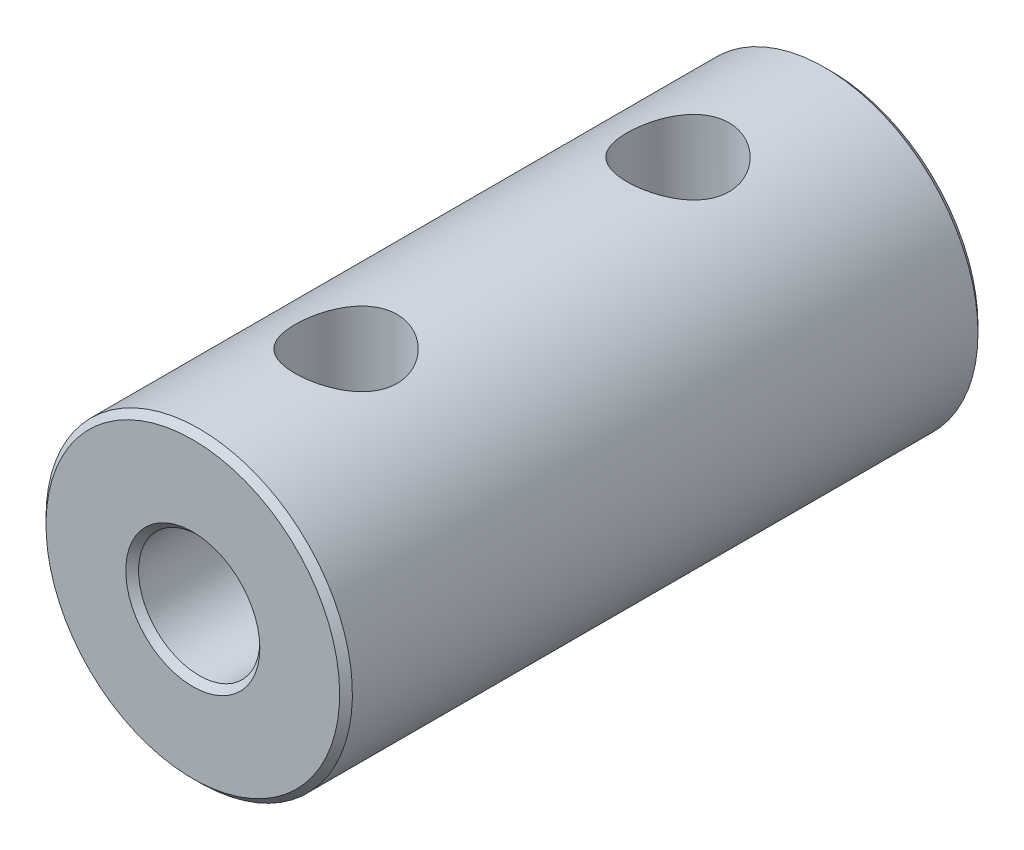
ISO-10303-21;
HEADER;
FILE_DESCRIPTION(('STEP AP214'),'2;1');
FILE_NAME('part.step','',(''),(''),'','','');
FILE_SCHEMA(('AUTOMOTIVE_DESIGN { 1 0 10303 214 1 1 1 1 }'));
ENDSEC;
DATA;
#1=APPLICATION_CONTEXT('core data for automotive mechanical design processes');
#2=APPLICATION_PROTOCOL_DEFINITION('international standard','automotive_design',2000,#1);
#3=PRODUCT_CONTEXT('',#1,'mechanical');
#4=PRODUCT('Part','Part','',(#3));
#5=PRODUCT_RELATED_PRODUCT_CATEGORY('part','',(#4));
#6=PRODUCT_DEFINITION_FORMATION('','',#4);
#7=PRODUCT_DEFINITION_CONTEXT('part definition',#1,'design');
#8=PRODUCT_DEFINITION('design','',#6,#7);
#9=PRODUCT_DEFINITION_SHAPE('','',#8);
#10=(LENGTH_UNIT() NAMED_UNIT(*) SI_UNIT(.MILLI.,.METRE.));
#11=(NAMED_UNIT(*) PLANE_ANGLE_UNIT() SI_UNIT($,.RADIAN.));
#12=(NAMED_UNIT(*) SI_UNIT($,.STERADIAN.) SOLID_ANGLE_UNIT());
#13=UNCERTAINTY_MEASURE_WITH_UNIT(LENGTH_MEASURE(1.E-05),#10,'distance_accuracy_value','');
#14=(GEOMETRIC_REPRESENTATION_CONTEXT(3) GLOBAL_UNCERTAINTY_ASSIGNED_CONTEXT((#13)) GLOBAL_UNIT_ASSIGNED_CONTEXT((#10,
#11,#12)) REPRESENTATION_CONTEXT('',''));
#15=CARTESIAN_POINT('',(0.,0.,0.));
#16=DIRECTION('',(0.,0.,1.));
#17=DIRECTION('',(1.,0.,0.));
#18=AXIS2_PLACEMENT_3D('',#15,#16,#17);
#19=CARTESIAN_POINT('',(0.,0.,-12.4999999999886));
#20=DIRECTION('',(0.,0.,-1.));
#21=DIRECTION('',(-1.,0.,0.));
#22=AXIS2_PLACEMENT_3D('',#19,#20,#21);
#23=CONICAL_SURFACE('',#22,2.62499999996635,0.785398163397448);
#24=CARTESIAN_POINT('',(0.,0.,-12.4999999999886));
#25=DIRECTION('',(0.,0.,-1.));
#26=DIRECTION('',(-1.,0.,0.));
#27=AXIS2_PLACEMENT_3D('',#24,#25,#26);
#28=CIRCLE('',#27,2.62499999996635);
#29=CARTESIAN_POINT('',(-2.62499999996635,0.,-12.4999999999886));
#30=VERTEX_POINT('',#29);
#31=EDGE_CURVE('E16',#30,#30,#28,.T.);
#32=ORIENTED_EDGE('',*,*,#31,.T.);
#33=EDGE_LOOP('',(#32));
#34=FACE_BOUND('',#33,.T.);
#35=CARTESIAN_POINT('',(0.,0.,-12.25));
#36=DIRECTION('',(0.,0.,1.));
#37=DIRECTION('',(1.,0.,0.));
#38=AXIS2_PLACEMENT_3D('',#35,#36,#37);
#39=CIRCLE('',#38,2.375);
#40=CARTESIAN_POINT('',(2.375,0.,-12.25));
#41=VERTEX_POINT('',#40);
#42=EDGE_CURVE('E31',#41,#41,#39,.T.);
#43=ORIENTED_EDGE('',*,*,#42,.T.);
#44=EDGE_LOOP('',(#43));
#45=FACE_BOUND('',#44,.T.);
#46=ADVANCED_FACE('F13',(#34,#45),#23,.F.);
#47=CARTESIAN_POINT('',(0.,0.,-12.5));
#48=DIRECTION('',(0.,0.,1.));
#49=DIRECTION('',(1.,0.,0.));
#50=AXIS2_PLACEMENT_3D('',#47,#48,#49);
#51=CYLINDRICAL_SURFACE('',#50,2.375);
#52=ORIENTED_EDGE('',*,*,#42,.F.);
#53=EDGE_LOOP('',(#52));
#54=FACE_BOUND('',#53,.T.);
#55=CARTESIAN_POINT('',(-1.73282538981153E-07,2.37499999999999,8.49999999999999));
#56=CARTESIAN_POINT('',(0.0947419904644373,2.37500085252827,8.50000088733846));
#57=CARTESIAN_POINT('',(0.189479491026323,2.36928502765977,8.49322341291771));
#58=CARTESIAN_POINT('',(0.375778503742495,2.34696172270018,8.46663560084138));
#59=CARTESIAN_POINT('',(0.467338664913177,2.33034966792908,8.44681978915115));
#60=CARTESIAN_POINT('',(0.644190674543106,2.28776712176158,8.39564071038123));
#61=CARTESIAN_POINT('',(0.729515922454296,2.26185169447299,8.36434536424898));
#62=CARTESIAN_POINT('',(0.892947077688107,2.20246391103889,8.29182938865656));
#63=CARTESIAN_POINT('',(0.971050187934863,2.16898864416243,8.25060493582948));
#64=CARTESIAN_POINT('',(1.14686778149014,2.08281778855047,8.14284035125767));
#65=CARTESIAN_POINT('',(1.24107340781026,2.02760410081355,8.07258704483248));
#66=CARTESIAN_POINT('',(1.41404617642997,1.91103021168391,7.91912489208194));
#67=CARTESIAN_POINT('',(1.49276953346194,1.84965329913678,7.83588046350767));
#68=CARTESIAN_POINT('',(1.63605513326426,1.72427410596949,7.65619931429162));
#69=CARTESIAN_POINT('',(1.70031612498385,1.66024403902476,7.5595397928448));
#70=CARTESIAN_POINT('',(1.78416487836378,1.56815837596459,7.40561948759947));
#71=CARTESIAN_POINT('',(1.81001039702083,1.53814254149055,7.35286395784179));
#72=CARTESIAN_POINT('',(1.85735130170314,1.48062511990155,7.24415143685075));
#73=CARTESIAN_POINT('',(1.87885034149605,1.45312143176195,7.18819718573973));
#74=CARTESIAN_POINT('',(1.91868802582077,1.40015892501363,7.06827624095072));
#75=CARTESIAN_POINT('',(1.9366391753578,1.3750368591001,7.00402625206968));
#76=CARTESIAN_POINT('',(1.96630784587296,1.33226890933339,6.87176174686672));
#77=CARTESIAN_POINT('',(1.9780399006272,1.31460561447291,6.80375642134802));
#78=CARTESIAN_POINT('',(1.99451816080289,1.28948404617587,6.66398570994358));
#79=CARTESIAN_POINT('',(1.9991701518379,1.28216349375168,6.59218255209626));
#80=CARTESIAN_POINT('',(2.00062485931371,1.2798942470508,6.44831276523212));
#81=CARTESIAN_POINT('',(1.99743024342982,1.28494134804015,6.37624623407443));
#82=CARTESIAN_POINT('',(1.98319149419916,1.30680501864147,6.23047235045875));
#83=CARTESIAN_POINT('',(1.97169719995691,1.3242956662608,6.15691736760948));
#84=CARTESIAN_POINT('',(1.94144010938427,1.36826005676273,6.01401291063177));
#85=CARTESIAN_POINT('',(1.92265242700902,1.39476451721871,5.94467878594336));
#86=CARTESIAN_POINT('',(1.88302753994746,1.44765504499219,5.82366053244057));
#87=CARTESIAN_POINT('',(1.86329757001999,1.47306379985148,5.77116427774767));
#88=CARTESIAN_POINT('',(1.82002302162662,1.52621101758855,5.66898014598909));
#89=CARTESIAN_POINT('',(1.79647607818539,1.55395091966721,5.61929403598513));
#90=CARTESIAN_POINT('',(1.72034079119687,1.63915440617836,5.47413402494443));
#91=CARTESIAN_POINT('',(1.66228068800848,1.69856939746462,5.38262578165102));
#92=CARTESIAN_POINT('',(1.52812852435649,1.82049632113512,5.20463060368423));
#93=CARTESIAN_POINT('',(1.45115142564149,1.88297565419158,5.11879214411931));
#94=CARTESIAN_POINT('',(1.28133772342652,2.00238187931346,4.95999179996099));
#95=CARTESIAN_POINT('',(1.18853231155767,2.05931935215519,4.88700515348696));
#96=CARTESIAN_POINT('',(1.00975737073252,2.15145805185702,4.7711044910946));
#97=CARTESIAN_POINT('',(0.926834509053543,2.1886796039416,4.72511077928113));
#98=CARTESIAN_POINT('',(0.752454955024109,2.25457223842807,4.64446404847242));
#99=CARTESIAN_POINT('',(0.661005027134542,2.28325002403221,4.60980213677146));
#100=CARTESIAN_POINT('',(0.476041998104976,2.32865276365432,4.55520790457744));
#101=CARTESIAN_POINT('',(0.382846400756408,2.34589191960153,4.53464031918457));
#102=CARTESIAN_POINT('',(0.193097587962324,2.36906179647756,4.50704077726662));
#103=CARTESIAN_POINT('',(0.0965463720868524,2.3749991382387,4.50000089591477));
#104=CARTESIAN_POINT('',(-0.0947421679821795,2.37500084565719,4.49999912082758));
#105=CARTESIAN_POINT('',(-0.189479671520166,2.36928501335014,4.50677660407527));
#106=CARTESIAN_POINT('',(-0.375778687946407,2.34696169329953,4.53336443422517));
#107=CARTESIAN_POINT('',(-0.467338849855433,2.33034963089364,4.55318025514093));
#108=CARTESIAN_POINT('',(-0.64419085893652,2.28776706990199,4.60435935216647));
#109=CARTESIAN_POINT('',(-0.729516105576798,2.26185163542998,4.63565470731943));
#110=CARTESIAN_POINT('',(-0.892947256832782,2.20246383842339,4.70817070053462));
#111=CARTESIAN_POINT('',(-0.971050364374242,2.16898856516042,4.74939516196064));
#112=CARTESIAN_POINT('',(-1.14686795429195,2.08281769361869,4.85715976886963));
#113=CARTESIAN_POINT('',(-1.24107357865281,2.02760399635189,4.92741308946873));
#114=CARTESIAN_POINT('',(-1.41404634102577,1.91103009001925,5.08087527131557));
#115=CARTESIAN_POINT('',(-1.49276969373123,1.84965316979235,5.1641197148398));
#116=CARTESIAN_POINT('',(-1.63605528239469,1.72427396444708,5.34380089581424));
#117=CARTESIAN_POINT('',(-1.70031626723579,1.66024389306779,5.44046043411128));
#118=CARTESIAN_POINT('',(-1.78416500756506,1.56815822889925,5.59438076657652));
#119=CARTESIAN_POINT('',(-1.81001052138868,1.53814239502314,5.64713630563105));
#120=CARTESIAN_POINT('',(-1.85735141525152,1.48062497733547,5.75584884602372));
#121=CARTESIAN_POINT('',(-1.87885044906395,1.45312129249437,5.81180310723535));
#122=CARTESIAN_POINT('',(-1.91868811425751,1.40015880340345,5.93172405853442));
#123=CARTESIAN_POINT('',(-1.93663925185408,1.37503675100747,5.99597404290758));
#124=CARTESIAN_POINT('',(-1.96630789926874,1.33226883016904,6.12823853701978));
#125=CARTESIAN_POINT('',(-1.97803994287238,1.31460555070135,6.19624385595309));
#126=CARTESIAN_POINT('',(-1.99451818180837,1.28948401345792,6.33601454994744));
#127=CARTESIAN_POINT('',(-1.99917016284883,1.28216347658043,6.4078176968941));
#128=CARTESIAN_POINT('',(-2.00062485309166,1.27989425674582,6.55168745878753));
#129=CARTESIAN_POINT('',(-1.99743022993147,1.28494136911442,6.6237539758777));
#130=CARTESIAN_POINT('',(-1.9831914665494,1.30680506076551,6.76952785636441));
#131=CARTESIAN_POINT('',(-1.97169716264017,1.32429572216333,6.84308284907517));
#132=CARTESIAN_POINT('',(-1.94144005122227,1.36826013962112,6.98598732333495));
#133=CARTESIAN_POINT('',(-1.92265235766466,1.39476461325098,7.0553214554361));
#134=CARTESIAN_POINT('',(-1.88302744825239,1.44765516457735,7.17633972376429));
#135=CARTESIAN_POINT('',(-1.86329746719413,1.47306393027707,7.22883598596939));
#136=CARTESIAN_POINT('',(-1.82002289517026,1.52621116873765,7.3310201317028));
#137=CARTESIAN_POINT('',(-1.79647593922862,1.55395108069871,7.38070624816884));
#138=CARTESIAN_POINT('',(-1.7203406125257,1.63915459516219,7.52586627711929));
#139=CARTESIAN_POINT('',(-1.66228047991188,1.69856960282488,7.61737453040697));
#140=CARTESIAN_POINT('',(-1.52812825202393,1.82049655133182,7.79536971952685));
#141=CARTESIAN_POINT('',(-1.45115111880865,1.88297589250501,7.88120818045777));
#142=CARTESIAN_POINT('',(-1.28133734152188,2.0023821253744,8.04000851970305));
#143=CARTESIAN_POINT('',(-1.18853188912507,2.05931959787382,8.11299515993743));
#144=CARTESIAN_POINT('',(-1.00975690150178,2.15145827187879,8.22889578233821));
#145=CARTESIAN_POINT('',(-0.926834037815443,2.18867980316166,8.27488946614742));
#146=CARTESIAN_POINT('',(-0.752454485484808,2.25457239476681,8.35553614126491));
#147=CARTESIAN_POINT('',(-0.66100456133487,2.28325015832956,8.39019802532806));
#148=CARTESIAN_POINT('',(-0.476041632938042,2.32865283431961,8.44479217981118));
#149=CARTESIAN_POINT('',(-0.382846137941889,2.3458919580327,8.46535972664188));
#150=CARTESIAN_POINT('',(-0.193097539200938,2.36906179610617,8.49295922224185));
#151=CARTESIAN_POINT('',(-0.0965464350065047,2.37499913123771,8.49999909576466));
#152=CARTESIAN_POINT('',(-1.73282538981153E-07,2.37499999999999,8.49999999999999));
#153=B_SPLINE_CURVE_WITH_KNOTS('',3,(#55,#56,#57,#58,#59,#60,#61,#62,#63,#64,#65,#66,#67,#68,
#69,#70,#71,#72,#73,#74,#75,#76,#77,#78,#79,#80,#81,#82,#83,#84,#85,#86,#87,#88,#89,#90,#91,#92,
#93,#94,#95,#96,#97,#98,#99,#100,#101,#102,#103,#104,#105,#106,#107,#108,#109,#110,#111,#112,
#113,#114,#115,#116,#117,#118,#119,#120,#121,#122,#123,#124,#125,#126,#127,#128,#129,#130,#131,
#132,#133,#134,#135,#136,#137,#138,#139,#140,#141,#142,#143,#144,#145,#146,#147,#148,#149,#150,
#151,#152),.UNSPECIFIED.,.T.,.F.,(4,2,2,2,2,2,2,2,2,2,2,2,2,2,2,2,2,2,2,2,2,2,2,2,2,2,2,2,2,2,2,
2,2,2,2,2,2,2,2,2,2,2,2,2,2,2,2,2,4),(0.,0.283823263096022,0.567765763066662,0.850054667854874,
1.1324524469336,1.51987334297024,1.90837462374963,2.30434274917393,2.50205230690881,
2.69959496718261,2.91285320491557,3.12561084468603,3.34117563077547,3.55666713968098,
3.78481958665969,4.01375746249826,4.19821930102314,4.38279587101769,4.75218069603702,
5.14413615716429,5.53532796266998,5.83978440631867,6.14400134899618,6.43339914519019,
6.72262735403823,7.00645062937804,7.29039314113401,7.5726820573931,7.85507984786294,
8.24250077464838,8.63100208705201,9.0269702451595,9.22467981856917,9.42222249429443,
9.63548069639574,9.84823830022988,10.0638030476167,10.2792945188481,10.5074470078374,
10.7363849257987,10.9208468076109,11.1054234209114,11.4748083324833,11.8667638675711,
12.257955746127,12.5624121341645,12.8666290199406,13.1560264845911,13.4452543632724),.UNSPECIFIED.);
#154=CARTESIAN_POINT('',(-1.73282538981153E-07,2.37499999999999,8.49999999999999));
#155=VERTEX_POINT('',#154);
#156=EDGE_CURVE('E81',#155,#155,#153,.T.);
#157=ORIENTED_EDGE('',*,*,#156,.T.);
#158=EDGE_LOOP('',(#157));
#159=FACE_BOUND('',#158,.T.);
#160=CARTESIAN_POINT('',(-1.73282539250827E-07,2.37499999999999,-4.50000000000001));
#161=CARTESIAN_POINT('',(0.0947419904644371,2.37500085252827,-4.49999911266154));
#162=CARTESIAN_POINT('',(0.189479491026323,2.36928502765977,-4.50677658708229));
#163=CARTESIAN_POINT('',(0.375778503742494,2.34696172270018,-4.53336439915862));
#164=CARTESIAN_POINT('',(0.467338664913176,2.33034966792908,-4.55318021084885));
#165=CARTESIAN_POINT('',(0.644190674543106,2.28776712176158,-4.60435928961877));
#166=CARTESIAN_POINT('',(0.729515922454296,2.26185169447299,-4.63565463575102));
#167=CARTESIAN_POINT('',(0.892947077688107,2.20246391103889,-4.70817061134344));
#168=CARTESIAN_POINT('',(0.971050187934863,2.16898864416243,-4.74939506417052));
#169=CARTESIAN_POINT('',(1.14686778149014,2.08281778855047,-4.85715964874233));
#170=CARTESIAN_POINT('',(1.24107340781026,2.02760410081355,-4.92741295516752));
#171=CARTESIAN_POINT('',(1.41404617642996,1.91103021168391,-5.08087510791806));
#172=CARTESIAN_POINT('',(1.49276953346194,1.84965329913678,-5.16411953649233));
#173=CARTESIAN_POINT('',(1.63605513326426,1.7242741059695,-5.34380068570838));
#174=CARTESIAN_POINT('',(1.70031612498385,1.66024403902476,-5.4404602071552));
#175=CARTESIAN_POINT('',(1.78416487836378,1.56815837596459,-5.59438051240053));
#176=CARTESIAN_POINT('',(1.81001039702083,1.53814254149055,-5.64713604215821));
#177=CARTESIAN_POINT('',(1.85735130170314,1.48062511990155,-5.75584856314925));
#178=CARTESIAN_POINT('',(1.87885034149605,1.45312143176195,-5.81180281426027));
#179=CARTESIAN_POINT('',(1.91868802582077,1.40015892501363,-5.93172375904928));
#180=CARTESIAN_POINT('',(1.9366391753578,1.3750368591001,-5.99597374793032));
#181=CARTESIAN_POINT('',(1.96630784587296,1.33226890933339,-6.12823825313327));
#182=CARTESIAN_POINT('',(1.9780399006272,1.31460561447291,-6.19624357865198));
#183=CARTESIAN_POINT('',(1.99451816080289,1.28948404617587,-6.33601429005641));
#184=CARTESIAN_POINT('',(1.9991701518379,1.28216349375168,-6.40781744790373));
#185=CARTESIAN_POINT('',(2.00062485931371,1.2798942470508,-6.55168723476788));
#186=CARTESIAN_POINT('',(1.99743024342982,1.28494134804015,-6.62375376592557));
#187=CARTESIAN_POINT('',(1.98319149419916,1.30680501864147,-6.76952764954124));
#188=CARTESIAN_POINT('',(1.97169719995691,1.3242956662608,-6.84308263239052));
#189=CARTESIAN_POINT('',(1.94144010938427,1.36826005676273,-6.98598708936823));
#190=CARTESIAN_POINT('',(1.92265242700902,1.39476451721871,-7.05532121405663));
#191=CARTESIAN_POINT('',(1.88302753994746,1.44765504499219,-7.17633946755943));
#192=CARTESIAN_POINT('',(1.86329757001999,1.47306379985148,-7.22883572225232));
#193=CARTESIAN_POINT('',(1.82002302162662,1.52621101758855,-7.33101985401091));
#194=CARTESIAN_POINT('',(1.79647607818539,1.5539509196672,-7.38070596401486));
#195=CARTESIAN_POINT('',(1.72034079119687,1.63915440617836,-7.52586597505556));
#196=CARTESIAN_POINT('',(1.66228068800848,1.69856939746462,-7.61737421834897));
#197=CARTESIAN_POINT('',(1.52812852435649,1.82049632113512,-7.79536939631577));
#198=CARTESIAN_POINT('',(1.45115142564149,1.88297565419158,-7.88120785588068));
#199=CARTESIAN_POINT('',(1.28133772342653,2.00238187931346,-8.04000820003901));
#200=CARTESIAN_POINT('',(1.18853231155767,2.05931935215519,-8.11299484651303));
#201=CARTESIAN_POINT('',(1.00975737073252,2.15145805185702,-8.22889550890539));
#202=CARTESIAN_POINT('',(0.926834509053546,2.1886796039416,-8.27488922071887));
#203=CARTESIAN_POINT('',(0.752454955024111,2.25457223842807,-8.35553595152758));
#204=CARTESIAN_POINT('',(0.661005027134544,2.28325002403221,-8.39019786322854));
#205=CARTESIAN_POINT('',(0.476041998104977,2.32865276365432,-8.44479209542255));
#206=CARTESIAN_POINT('',(0.382846400756408,2.34589191960153,-8.46535968081543));
#207=CARTESIAN_POINT('',(0.193097587962323,2.36906179647756,-8.49295922273338));
#208=CARTESIAN_POINT('',(0.096546372086852,2.3749991382387,-8.49999910408523));
#209=CARTESIAN_POINT('',(-0.0947421679821799,2.37500084565719,-8.50000087917242));
#210=CARTESIAN_POINT('',(-0.189479671520167,2.36928501335014,-8.49322339592472));
#211=CARTESIAN_POINT('',(-0.375778687946408,2.34696169329953,-8.46663556577482));
#212=CARTESIAN_POINT('',(-0.467338849855433,2.33034963089364,-8.44681974485907));
#213=CARTESIAN_POINT('',(-0.64419085893652,2.28776706990199,-8.39564064783353));
#214=CARTESIAN_POINT('',(-0.729516105576798,2.26185163542998,-8.36434529268057));
#215=CARTESIAN_POINT('',(-0.892947256832782,2.20246383842339,-8.29182929946538));
#216=CARTESIAN_POINT('',(-0.971050364374242,2.16898856516042,-8.25060483803936));
#217=CARTESIAN_POINT('',(-1.14686795429195,2.08281769361869,-8.14284023113037));
#218=CARTESIAN_POINT('',(-1.24107357865281,2.02760399635189,-8.07258691053126));
#219=CARTESIAN_POINT('',(-1.41404634102577,1.91103009001925,-7.91912472868442));
#220=CARTESIAN_POINT('',(-1.49276969373123,1.84965316979235,-7.83588028516019));
#221=CARTESIAN_POINT('',(-1.63605528239469,1.72427396444708,-7.65619910418576));
#222=CARTESIAN_POINT('',(-1.70031626723579,1.66024389306779,-7.55953956588872));
#223=CARTESIAN_POINT('',(-1.78416500756506,1.56815822889925,-7.40561923342347));
#224=CARTESIAN_POINT('',(-1.81001052138868,1.53814239502314,-7.35286369436895));
#225=CARTESIAN_POINT('',(-1.85735141525152,1.48062497733547,-7.24415115397628));
#226=CARTESIAN_POINT('',(-1.87885044906395,1.45312129249437,-7.18819689276465));
#227=CARTESIAN_POINT('',(-1.91868811425751,1.40015880340345,-7.06827594146558));
#228=CARTESIAN_POINT('',(-1.93663925185408,1.37503675100748,-7.00402595709241));
#229=CARTESIAN_POINT('',(-1.96630789926874,1.33226883016904,-6.87176146298022));
#230=CARTESIAN_POINT('',(-1.97803994287238,1.31460555070135,-6.80375614404691));
#231=CARTESIAN_POINT('',(-1.99451818180837,1.28948401345792,-6.66398545005256));
#232=CARTESIAN_POINT('',(-1.99917016284883,1.28216347658043,-6.59218230310589));
#233=CARTESIAN_POINT('',(-2.00062485309166,1.27989425674582,-6.44831254121247));
#234=CARTESIAN_POINT('',(-1.99743022993147,1.28494136911442,-6.37624602412229));
#235=CARTESIAN_POINT('',(-1.9831914665494,1.30680506076551,-6.23047214363558));
#236=CARTESIAN_POINT('',(-1.97169716264017,1.32429572216333,-6.15691715092483));
#237=CARTESIAN_POINT('',(-1.94144005122227,1.36826013962112,-6.01401267666505));
#238=CARTESIAN_POINT('',(-1.92265235766466,1.39476461325098,-5.9446785445639));
#239=CARTESIAN_POINT('',(-1.88302744825239,1.44765516457735,-5.82366027623571));
#240=CARTESIAN_POINT('',(-1.86329746719413,1.47306393027707,-5.77116401403061));
#241=CARTESIAN_POINT('',(-1.82002289517026,1.52621116873766,-5.6689798682972));
#242=CARTESIAN_POINT('',(-1.79647593922862,1.55395108069871,-5.61929375183115));
#243=CARTESIAN_POINT('',(-1.7203406125257,1.63915459516219,-5.4741337228807));
#244=CARTESIAN_POINT('',(-1.66228047991188,1.69856960282488,-5.38262546959302));
#245=CARTESIAN_POINT('',(-1.52812825202393,1.82049655133182,-5.20463028047315));
#246=CARTESIAN_POINT('',(-1.45115111880865,1.88297589250501,-5.11879181954222));
#247=CARTESIAN_POINT('',(-1.28133734152188,2.0023821253744,-4.95999148029695));
#248=CARTESIAN_POINT('',(-1.18853188912507,2.05931959787382,-4.88700484006257));
#249=CARTESIAN_POINT('',(-1.00975690150178,2.15145827187879,-4.77110421766179));
#250=CARTESIAN_POINT('',(-0.926834037815442,2.18867980316166,-4.72511053385257));
#251=CARTESIAN_POINT('',(-0.752454485484806,2.25457239476681,-4.64446385873509));
#252=CARTESIAN_POINT('',(-0.661004561334869,2.28325015832956,-4.60980197467194));
#253=CARTESIAN_POINT('',(-0.476041632938041,2.32865283431961,-4.55520782018881));
#254=CARTESIAN_POINT('',(-0.382846137941888,2.3458919580327,-4.53464027335812));
#255=CARTESIAN_POINT('',(-0.193097539200938,2.36906179610616,-4.50704077775814));
#256=CARTESIAN_POINT('',(-0.096546435006505,2.37499913123771,-4.50000090423534));
#257=CARTESIAN_POINT('',(-1.73282539250827E-07,2.37499999999999,-4.50000000000001));
#258=B_SPLINE_CURVE_WITH_KNOTS('',3,(#160,#161,#162,#163,#164,#165,#166,#167,#168,#169,#170,
#171,#172,#173,#174,#175,#176,#177,#178,#179,#180,#181,#182,#183,#184,#185,#186,#187,#188,#189,
#190,#191,#192,#193,#194,#195,#196,#197,#198,#199,#200,#201,#202,#203,#204,#205,#206,#207,#208,
#209,#210,#211,#212,#213,#214,#215,#216,#217,#218,#219,#220,#221,#222,#223,#224,#225,#226,#227,
#228,#229,#230,#231,#232,#233,#234,#235,#236,#237,#238,#239,#240,#241,#242,#243,#244,#245,#246,
#247,#248,#249,#250,#251,#252,#253,#254,#255,#256,#257),.UNSPECIFIED.,.T.,.F.,(4,2,2,2,2,2,2,2,
2,2,2,2,2,2,2,2,2,2,2,2,2,2,2,2,2,2,2,2,2,2,2,2,2,2,2,2,2,2,2,2,2,2,2,2,2,2,2,2,4),(0.,
0.283823263096022,0.567765763066662,0.850054667854874,1.1324524469336,1.51987334297024,
1.90837462374962,2.30434274917393,2.50205230690881,2.6995949671826,2.91285320491556,
3.12561084468602,3.34117563077546,3.55666713968098,3.78481958665969,4.01375746249826,
4.19821930102313,4.38279587101769,4.75218069603702,5.14413615716428,5.53532796266997,
5.83978440631867,6.14400134899618,6.4333991451902,6.72262735403824,7.00645062937804,
7.29039314113401,7.5726820573931,7.85507984786294,8.24250077464838,8.63100208705201,
9.0269702451595,9.22467981856917,9.42222249429444,9.63548069639575,9.84823830022989,
10.0638030476167,10.2792945188481,10.5074470078374,10.7363849257987,10.9208468076109,
11.1054234209115,11.4748083324833,11.8667638675711,12.257955746127,12.5624121341645,
12.8666290199406,13.1560264845911,13.4452543632724),.UNSPECIFIED.);
#259=CARTESIAN_POINT('',(-1.73282539250827E-07,2.37499999999999,-4.50000000000001));
#260=VERTEX_POINT('',#259);
#261=EDGE_CURVE('E85',#260,#260,#258,.T.);
#262=ORIENTED_EDGE('',*,*,#261,.T.);
#263=EDGE_LOOP('',(#262));
#264=FACE_BOUND('',#263,.T.);
#265=CARTESIAN_POINT('',(0.,0.,12.2500000000514));
#266=DIRECTION('',(0.,0.,1.));
#267=DIRECTION('',(1.,0.,0.));
#268=AXIS2_PLACEMENT_3D('',#265,#266,#267);
#269=CIRCLE('',#268,2.37499999997226);
#270=CARTESIAN_POINT('',(2.37499999997226,0.,12.2500000000514));
#271=VERTEX_POINT('',#270);
#272=EDGE_CURVE('E28',#271,#271,#269,.T.);
#273=ORIENTED_EDGE('',*,*,#272,.T.);
#274=EDGE_LOOP('',(#273));
#275=FACE_BOUND('',#274,.T.);
#276=ADVANCED_FACE('F91',(#54,#159,#264,#275),#51,.F.);
#277=CARTESIAN_POINT('',(0.,0.,12.5000000000455));
#278=DIRECTION('',(0.,0.,1.));
#279=DIRECTION('',(1.,0.,0.));
#280=AXIS2_PLACEMENT_3D('',#277,#278,#279);
#281=CONICAL_SURFACE('',#280,2.62499999996635,0.785398163397448);
#282=ORIENTED_EDGE('',*,*,#272,.F.);
#283=EDGE_LOOP('',(#282));
#284=FACE_BOUND('',#283,.T.);
#285=CARTESIAN_POINT('',(0.,0.,12.5000000000455));
#286=DIRECTION('',(0.,0.,1.));
#287=DIRECTION('',(1.,0.,0.));
#288=AXIS2_PLACEMENT_3D('',#285,#286,#287);
#289=CIRCLE('',#288,2.62499999996635);
#290=CARTESIAN_POINT('',(2.62499999996635,0.,12.5000000000455));
#291=VERTEX_POINT('',#290);
#292=EDGE_CURVE('E76',#291,#291,#289,.F.);
#293=ORIENTED_EDGE('',*,*,#292,.F.);
#294=EDGE_LOOP('',(#293));
#295=FACE_BOUND('',#294,.T.);
#296=ADVANCED_FACE('F95',(#284,#295),#281,.F.);
#297=CARTESIAN_POINT('',(0.,0.,-12.5));
#298=DIRECTION('',(0.,0.,1.));
#299=DIRECTION('',(1.,0.,0.));
#300=AXIS2_PLACEMENT_3D('',#297,#298,#299);
#301=PLANE('',#300);
#302=ORIENTED_EDGE('',*,*,#31,.F.);
#303=EDGE_LOOP('',(#302));
#304=FACE_BOUND('',#303,.T.);
#305=CARTESIAN_POINT('',(0.,0.,-12.4999999999886));
#306=DIRECTION('',(0.,0.,1.));
#307=DIRECTION('',(1.,0.,0.));
#308=AXIS2_PLACEMENT_3D('',#305,#306,#307);
#309=CIRCLE('',#308,5.74999999997772);
#310=CARTESIAN_POINT('',(5.74999999997772,0.,-12.4999999999886));
#311=VERTEX_POINT('',#310);
#312=EDGE_CURVE('E80',#311,#311,#309,.T.);
#313=ORIENTED_EDGE('',*,*,#312,.F.);
#314=EDGE_LOOP('',(#313));
#315=FACE_BOUND('',#314,.T.);
#316=ADVANCED_FACE('F100',(#304,#315),#301,.F.);
#317=CARTESIAN_POINT('',(0.,6.,-6.5));
#318=DIRECTION('',(0.,-1.,0.));
#319=DIRECTION('',(0.,0.,-1.));
#320=AXIS2_PLACEMENT_3D('',#317,#318,#319);
#321=CYLINDRICAL_SURFACE('',#320,2.);
#322=CARTESIAN_POINT('',(0.,6.,-8.5));
#323=CARTESIAN_POINT('',(0.108974724981257,5.99999564043199,-8.49999387582771));
#324=CARTESIAN_POINT('',(0.218061624312814,5.99699891987264,-8.49105182399998));
#325=CARTESIAN_POINT('',(0.433135507861889,5.98531898777214,-8.45558502236712));
#326=CARTESIAN_POINT('',(0.53911702572106,5.97662631229205,-8.42903100905125));
#327=CARTESIAN_POINT('',(0.744677391020186,5.95450405936115,-8.35935545127125));
#328=CARTESIAN_POINT('',(0.844270322148516,5.94108535671894,-8.31627192183003));
#329=CARTESIAN_POINT('',(1.03478027317621,5.91088362977992,-8.2148991103415));
#330=CARTESIAN_POINT('',(1.12569835120873,5.89410101657939,-8.15661168606746));
#331=CARTESIAN_POINT('',(1.29948066120753,5.85828234356817,-8.02435012782239));
#332=CARTESIAN_POINT('',(1.38200296985306,5.83919212564537,-7.94994143266665));
#333=CARTESIAN_POINT('',(1.53366185688878,5.80120729301479,-7.78847026401049));
#334=CARTESIAN_POINT('',(1.60279478510015,5.78231273297186,-7.70140435122455));
#335=CARTESIAN_POINT('',(1.72765000460817,5.74626660527703,-7.5140295470131));
#336=CARTESIAN_POINT('',(1.78292996263521,5.72918070675597,-7.41341205845342));
#337=CARTESIAN_POINT('',(1.87563792582484,5.69950605118217,-7.20364731331042));
#338=CARTESIAN_POINT('',(1.91307145997706,5.68691590160801,-7.09450271071936));
#339=CARTESIAN_POINT('',(1.96774691998398,5.668226065766,-6.87465356222404));
#340=CARTESIAN_POINT('',(1.98562689485105,5.66192191595818,-6.76412559368512));
#341=CARTESIAN_POINT('',(2.00268224673318,5.65591313259804,-6.54147250227214));
#342=CARTESIAN_POINT('',(2.00186340191249,5.65620646034393,-6.42934788348553));
#343=CARTESIAN_POINT('',(1.98203983171075,5.66318029215463,-6.21212698718519));
#344=CARTESIAN_POINT('',(1.9638679178329,5.66956828732703,-6.10694368678634));
#345=CARTESIAN_POINT('',(1.91121248100332,5.68753310014688,-5.90121363239284));
#346=CARTESIAN_POINT('',(1.87672692891572,5.69911056326544,-5.80066745688463));
#347=CARTESIAN_POINT('',(1.79187699568072,5.72635859066114,-5.60517186518129));
#348=CARTESIAN_POINT('',(1.74126547755007,5.74209216039441,-5.51033887481629));
#349=CARTESIAN_POINT('',(1.62577463722154,5.77585213820706,-5.3302535979963));
#350=CARTESIAN_POINT('',(1.56089195549305,5.79387908574147,-5.24500357459028));
#351=CARTESIAN_POINT('',(1.41471183692283,5.83134330407195,-5.08183112598559));
#352=CARTESIAN_POINT('',(1.33273573335404,5.85080514069166,-5.00452116088846));
#353=CARTESIAN_POINT('',(1.15670997003856,5.88813263419032,-4.86455883225799));
#354=CARTESIAN_POINT('',(1.0626550483703,5.90599758962958,-4.80191289061779));
#355=CARTESIAN_POINT('',(0.863814830016826,5.93835612232543,-4.69256071527911));
#356=CARTESIAN_POINT('',(0.758926252035819,5.95281190958588,-4.6460306935648));
#357=CARTESIAN_POINT('',(0.5423264009679,5.97642703507924,-4.57154393292385));
#358=CARTESIAN_POINT('',(0.430629608192132,5.98559720854271,-4.54354918001532));
#359=CARTESIAN_POINT('',(0.264915824950258,5.99438078240147,-4.51690890600764));
#360=CARTESIAN_POINT('',(0.212162754998664,5.99648164277423,-4.51057599508963));
#361=CARTESIAN_POINT('',(0.106282188413202,5.99929231383764,-4.50212005135746));
#362=CARTESIAN_POINT('',(0.053154691094102,6.00000212198189,-4.49999702624973));
#363=CARTESIAN_POINT('',(-0.108974320546921,5.99999564958798,-4.50000609667744));
#364=CARTESIAN_POINT('',(-0.218061323528978,5.99699893262229,-4.50894813754687));
#365=CARTESIAN_POINT('',(-0.43313541065078,5.98531899665215,-4.5444149504166));
#366=CARTESIAN_POINT('',(-0.5391170284132,5.97662631366986,-4.57096898604614));
#367=CARTESIAN_POINT('',(-0.744677496409074,5.95450404635534,-4.64064459025091));
#368=CARTESIAN_POINT('',(-0.844270435398143,5.94108534074146,-4.68372813013403));
#369=CARTESIAN_POINT('',(-1.03478039910894,5.91088360783663,-4.78510096497113));
#370=CARTESIAN_POINT('',(-1.1256984819936,5.89410099165341,-4.84338840209979));
#371=CARTESIAN_POINT('',(-1.29948079031559,5.85828231486169,-4.97564998216421));
#372=CARTESIAN_POINT('',(-1.38200309339087,5.83919209632779,-5.0500586849952));
#373=CARTESIAN_POINT('',(-1.53366196810197,5.80120726353239,-5.21152986827375));
#374=CARTESIAN_POINT('',(-1.60279488955532,5.78231270393607,-5.29859578800975));
#375=CARTESIAN_POINT('',(-1.72765009347102,5.74626657846581,-5.48597060436773));
#376=CARTESIAN_POINT('',(-1.78293004279498,5.72918068173044,-5.58658809797993));
#377=CARTESIAN_POINT('',(-1.87563798775177,5.6995060307227,-5.79635285172487));
#378=CARTESIAN_POINT('',(-1.91307151237704,5.68691588392797,-5.90549745786459));
#379=CARTESIAN_POINT('',(-1.96774695269891,5.66822605435653,-6.12534661001365));
#380=CARTESIAN_POINT('',(-1.98562691768516,5.66192190793442,-6.23587457864594));
#381=CARTESIAN_POINT('',(-2.00268225018104,5.65591313136026,-6.45852766839853));
#382=CARTESIAN_POINT('',(-2.00186339585291,5.65620646250711,-6.57065228543214));
#383=CARTESIAN_POINT('',(-1.98203980773168,5.66318030056368,-6.78787317766876));
#384=CARTESIAN_POINT('',(-1.96386788524613,5.66956829865742,-6.89305647581523));
#385=CARTESIAN_POINT('',(-1.91121243185297,5.68753311670547,-7.09878652434845));
#386=CARTESIAN_POINT('',(-1.87672687180841,5.69911058213118,-7.19933269624825));
#387=CARTESIAN_POINT('',(-1.79187692261316,5.72635861359328,-7.39482828125607));
#388=CARTESIAN_POINT('',(-1.74126539622438,5.74209218514089,-7.48966126838996));
#389=CARTESIAN_POINT('',(-1.62577453981408,5.77585216570963,-7.66974653748576));
#390=CARTESIAN_POINT('',(-1.56089185026084,5.79387911418577,-7.75499655639758));
#391=CARTESIAN_POINT('',(-1.41471171629023,5.83134333344032,-7.91816899444523));
#392=CARTESIAN_POINT('',(-1.33273560519138,5.85080516999041,-7.9954789534292));
#393=CARTESIAN_POINT('',(-1.15670982770431,5.88813266225514,-8.13544126850084));
#394=CARTESIAN_POINT('',(-1.0626548994014,5.9059976165305,-8.19808720270277));
#395=CARTESIAN_POINT('',(-0.863814670607853,5.93835614558165,-8.30743936086934));
#396=CARTESIAN_POINT('',(-0.758926089007412,5.9528119304141,-8.35396937313319));
#397=CARTESIAN_POINT('',(-0.542326232290177,5.97642705043383,-8.42845611449364));
#398=CARTESIAN_POINT('',(-0.430629437466877,5.98559722084255,-8.45645085753652));
#399=CARTESIAN_POINT('',(-0.264915597802177,5.99438079292697,-8.48309112581857));
#400=CARTESIAN_POINT('',(-0.212162472103961,5.99648165327739,-8.48942403655699));
#401=CARTESIAN_POINT('',(-0.106281794097408,5.99929232131198,-8.49787997108108));
#402=CARTESIAN_POINT('',(-0.0531542411044577,6.00000212645207,-8.50000298716726));
#403=CARTESIAN_POINT('',(0.,6.,-8.5));
#404=B_SPLINE_CURVE_WITH_KNOTS('',3,(#322,#323,#324,#325,#326,#327,#328,#329,#330,#331,#332,
#333,#334,#335,#336,#337,#338,#339,#340,#341,#342,#343,#344,#345,#346,#347,#348,#349,#350,#351,
#352,#353,#354,#355,#356,#357,#358,#359,#360,#361,#362,#363,#364,#365,#366,#367,#368,#369,#370,
#371,#372,#373,#374,#375,#376,#377,#378,#379,#380,#381,#382,#383,#384,#385,#386,#387,#388,#389,
#390,#391,#392,#393,#394,#395,#396,#397,#398,#399,#400,#401,#402,#403),.UNSPECIFIED.,.T.,.F.,(4,
2,2,2,2,2,2,2,2,2,2,2,2,2,2,2,2,2,2,2,2,2,2,2,2,2,2,2,2,2,2,2,2,2,2,2,2,2,2,2,4),(0.,
0.326719078080396,0.653982387409555,0.980497516321068,1.30697276682225,1.64368488945775,
1.98048867688439,2.32696849728256,2.67334090511244,3.00803851018782,3.34263269100475,
3.66193579659862,3.98127862845115,4.30577211014922,4.63034206176842,4.97180786329589,
5.31342292613219,5.65866330611884,6.00319342110397,6.16255564822468,6.32191816706695,
6.64863754680833,6.97590115947829,7.30241632307292,7.62889160714282,7.96560373306213,
8.30240752385661,8.64888734412926,8.99525975178409,9.32995735188368,9.66455152776047,
9.98385463167145,10.3031974618634,10.6276909474138,10.9522609029137,11.2937267081405,
11.6353417744931,11.9805821519628,12.3251122651211,12.4844746575578,12.6438373414526),.UNSPECIFIED.);
#405=CARTESIAN_POINT('',(0.,6.,-8.5));
#406=VERTEX_POINT('',#405);
#407=EDGE_CURVE('E43',#406,#406,#404,.T.);
#408=ORIENTED_EDGE('',*,*,#407,.F.);
#409=EDGE_LOOP('',(#408));
#410=FACE_BOUND('',#409,.T.);
#411=ORIENTED_EDGE('',*,*,#261,.F.);
#412=EDGE_LOOP('',(#411));
#413=FACE_BOUND('',#412,.T.);
#414=ADVANCED_FACE('F71',(#410,#413),#321,.F.);
#415=CARTESIAN_POINT('',(0.,6.,6.5));
#416=DIRECTION('',(0.,-1.,0.));
#417=DIRECTION('',(0.,0.,-1.));
#418=AXIS2_PLACEMENT_3D('',#415,#416,#417);
#419=CYLINDRICAL_SURFACE('',#418,2.);
#420=CARTESIAN_POINT('',(0.,6.,4.5));
#421=CARTESIAN_POINT('',(0.108974724981258,5.99999564043199,4.50000612417229));
#422=CARTESIAN_POINT('',(0.218061624312814,5.99699891987264,4.50894817600002));
#423=CARTESIAN_POINT('',(0.43313550786189,5.98531898777214,4.54441497763288));
#424=CARTESIAN_POINT('',(0.539117025721061,5.97662631229205,4.57096899094875));
#425=CARTESIAN_POINT('',(0.744677391020187,5.95450405936115,4.64064454872875));
#426=CARTESIAN_POINT('',(0.844270322148517,5.94108535671894,4.68372807816997));
#427=CARTESIAN_POINT('',(1.03478027317622,5.91088362977992,4.7851008896585));
#428=CARTESIAN_POINT('',(1.12569835120873,5.89410101657939,4.84338831393254));
#429=CARTESIAN_POINT('',(1.29948066120753,5.85828234356817,4.97564987217761));
#430=CARTESIAN_POINT('',(1.38200296985306,5.83919212564537,5.05005856733335));
#431=CARTESIAN_POINT('',(1.53366185688878,5.80120729301479,5.21152973598951));
#432=CARTESIAN_POINT('',(1.60279478510015,5.78231273297186,5.29859564877545));
#433=CARTESIAN_POINT('',(1.72765000460817,5.74626660527703,5.4859704529869));
#434=CARTESIAN_POINT('',(1.78292996263521,5.72918070675597,5.58658794154658));
#435=CARTESIAN_POINT('',(1.87563792582484,5.69950605118217,5.79635268668958));
#436=CARTESIAN_POINT('',(1.91307145997706,5.68691590160801,5.90549728928064));
#437=CARTESIAN_POINT('',(1.96774691998398,5.668226065766,6.12534643777596));
#438=CARTESIAN_POINT('',(1.98562689485105,5.66192191595818,6.23587440631488));
#439=CARTESIAN_POINT('',(2.00268224673318,5.65591313259804,6.45852749772786));
#440=CARTESIAN_POINT('',(2.00186340191249,5.65620646034393,6.57065211651447));
#441=CARTESIAN_POINT('',(1.98203983171075,5.66318029215463,6.7878730128148));
#442=CARTESIAN_POINT('',(1.9638679178329,5.66956828732703,6.89305631321365));
#443=CARTESIAN_POINT('',(1.91121248100332,5.68753310014688,7.09878636760715));
#444=CARTESIAN_POINT('',(1.87672692891572,5.69911056326544,7.19933254311537));
#445=CARTESIAN_POINT('',(1.79187699568072,5.72635859066114,7.39482813481871));
#446=CARTESIAN_POINT('',(1.74126547755007,5.74209216039441,7.48966112518371));
#447=CARTESIAN_POINT('',(1.62577463722154,5.77585213820706,7.6697464020037));
#448=CARTESIAN_POINT('',(1.56089195549305,5.79387908574146,7.75499642540971));
#449=CARTESIAN_POINT('',(1.41471183692283,5.83134330407195,7.91816887401441));
#450=CARTESIAN_POINT('',(1.33273573335404,5.85080514069166,7.99547883911154));
#451=CARTESIAN_POINT('',(1.15670997003856,5.88813263419032,8.13544116774201));
#452=CARTESIAN_POINT('',(1.0626550483703,5.90599758962958,8.19808710938221));
#453=CARTESIAN_POINT('',(0.863814830016824,5.93835612232543,8.30743928472089));
#454=CARTESIAN_POINT('',(0.758926252035817,5.95281190958588,8.3539693064352));
#455=CARTESIAN_POINT('',(0.542326400967898,5.97642703507924,8.42845606707614));
#456=CARTESIAN_POINT('',(0.43062960819213,5.98559720854271,8.45645081998468));
#457=CARTESIAN_POINT('',(0.264915824950257,5.99438078240147,8.48309109399236));
#458=CARTESIAN_POINT('',(0.212162754998662,5.99648164277423,8.48942400491037));
#459=CARTESIAN_POINT('',(0.106282188413201,5.99929231383764,8.49787994864254));
#460=CARTESIAN_POINT('',(0.0531546910941009,6.00000212198189,8.50000297375026));
#461=CARTESIAN_POINT('',(-0.108974320546922,5.99999564958798,8.49999390332256));
#462=CARTESIAN_POINT('',(-0.218061323528978,5.99699893262229,8.49105186245313));
#463=CARTESIAN_POINT('',(-0.43313541065078,5.98531899665215,8.4555850495834));
#464=CARTESIAN_POINT('',(-0.5391170284132,5.97662631366986,8.42903101395386));
#465=CARTESIAN_POINT('',(-0.744677496409074,5.95450404635534,8.35935540974908));
#466=CARTESIAN_POINT('',(-0.844270435398143,5.94108534074146,8.31627186986596));
#467=CARTESIAN_POINT('',(-1.03478039910894,5.91088360783663,8.21489903502887));
#468=CARTESIAN_POINT('',(-1.1256984819936,5.89410099165341,8.15661159790021));
#469=CARTESIAN_POINT('',(-1.29948079031559,5.85828231486169,8.02435001783578));
#470=CARTESIAN_POINT('',(-1.38200309339087,5.83919209632779,7.9499413150048));
#471=CARTESIAN_POINT('',(-1.53366196810197,5.80120726353239,7.78847013172625));
#472=CARTESIAN_POINT('',(-1.60279488955532,5.78231270393607,7.70140421199025));
#473=CARTESIAN_POINT('',(-1.72765009347102,5.74626657846581,7.51402939563227));
#474=CARTESIAN_POINT('',(-1.78293004279498,5.72918068173044,7.41341190202007));
#475=CARTESIAN_POINT('',(-1.87563798775177,5.6995060307227,7.20364714827513));
#476=CARTESIAN_POINT('',(-1.91307151237704,5.68691588392797,7.09450254213541));
#477=CARTESIAN_POINT('',(-1.96774695269891,5.66822605435653,6.87465338998635));
#478=CARTESIAN_POINT('',(-1.98562691768516,5.66192190793442,6.76412542135406));
#479=CARTESIAN_POINT('',(-2.00268225018104,5.65591313136026,6.54147233160147));
#480=CARTESIAN_POINT('',(-2.00186339585291,5.65620646250711,6.42934771456786));
#481=CARTESIAN_POINT('',(-1.98203980773168,5.66318030056368,6.21212682233123));
#482=CARTESIAN_POINT('',(-1.96386788524613,5.66956829865742,6.10694352418476));
#483=CARTESIAN_POINT('',(-1.91121243185297,5.68753311670547,5.90121347565155));
#484=CARTESIAN_POINT('',(-1.87672687180841,5.69911058213118,5.80066730375175));
#485=CARTESIAN_POINT('',(-1.79187692261316,5.72635861359328,5.60517171874393));
#486=CARTESIAN_POINT('',(-1.74126539622438,5.74209218514089,5.51033873161004));
#487=CARTESIAN_POINT('',(-1.62577453981408,5.77585216570963,5.33025346251424));
#488=CARTESIAN_POINT('',(-1.56089185026084,5.79387911418577,5.24500344360242));
#489=CARTESIAN_POINT('',(-1.41471171629023,5.83134333344032,5.08183100555476));
#490=CARTESIAN_POINT('',(-1.33273560519138,5.85080516999041,5.0045210465708));
#491=CARTESIAN_POINT('',(-1.15670982770431,5.88813266225514,4.86455873149915));
#492=CARTESIAN_POINT('',(-1.0626548994014,5.9059976165305,4.80191279729722));
#493=CARTESIAN_POINT('',(-0.863814670607853,5.93835614558165,4.69256063913065));
#494=CARTESIAN_POINT('',(-0.758926089007412,5.9528119304141,4.64603062686681));
#495=CARTESIAN_POINT('',(-0.542326232290176,5.97642705043383,4.57154388550636));
#496=CARTESIAN_POINT('',(-0.430629437466876,5.98559722084255,4.54354914246348));
#497=CARTESIAN_POINT('',(-0.264915597802177,5.99438079292697,4.51690887418143));
#498=CARTESIAN_POINT('',(-0.212162472103961,5.99648165327739,4.510575963443));
#499=CARTESIAN_POINT('',(-0.106281794097408,5.99929232131198,4.50212002891891));
#500=CARTESIAN_POINT('',(-0.0531542411044576,6.00000212645207,4.49999701283274));
#501=CARTESIAN_POINT('',(0.,6.,4.5));
#502=B_SPLINE_CURVE_WITH_KNOTS('',3,(#420,#421,#422,#423,#424,#425,#426,#427,#428,#429,#430,
#431,#432,#433,#434,#435,#436,#437,#438,#439,#440,#441,#442,#443,#444,#445,#446,#447,#448,#449,
#450,#451,#452,#453,#454,#455,#456,#457,#458,#459,#460,#461,#462,#463,#464,#465,#466,#467,#468,
#469,#470,#471,#472,#473,#474,#475,#476,#477,#478,#479,#480,#481,#482,#483,#484,#485,#486,#487,
#488,#489,#490,#491,#492,#493,#494,#495,#496,#497,#498,#499,#500,#501),.UNSPECIFIED.,.T.,.F.,(4,
2,2,2,2,2,2,2,2,2,2,2,2,2,2,2,2,2,2,2,2,2,2,2,2,2,2,2,2,2,2,2,2,2,2,2,2,2,2,2,4),(0.,
0.326719078080396,0.653982387409556,0.98049751632107,1.30697276682226,1.64368488945775,
1.98048867688439,2.32696849728256,2.67334090511244,3.00803851018782,3.34263269100475,
3.66193579659862,3.98127862845115,4.30577211014922,4.63034206176842,4.97180786329589,
5.31342292613219,5.65866330611884,6.00319342110397,6.16255564822468,6.32191816706695,
6.64863754680833,6.97590115947829,7.30241632307292,7.62889160714282,7.96560373306213,
8.30240752385661,8.64888734412926,8.99525975178409,9.32995735188368,9.66455152776047,
9.98385463167145,10.3031974618634,10.6276909474138,10.9522609029137,11.2937267081404,
11.6353417744931,11.9805821519628,12.3251122651211,12.4844746575578,12.6438373414526),.UNSPECIFIED.);
#503=CARTESIAN_POINT('',(0.,6.,4.5));
#504=VERTEX_POINT('',#503);
#505=EDGE_CURVE('E36',#504,#504,#502,.T.);
#506=ORIENTED_EDGE('',*,*,#505,.F.);
#507=EDGE_LOOP('',(#506));
#508=FACE_BOUND('',#507,.T.);
#509=ORIENTED_EDGE('',*,*,#156,.F.);
#510=EDGE_LOOP('',(#509));
#511=FACE_BOUND('',#510,.T.);
#512=ADVANCED_FACE('F48',(#508,#511),#419,.F.);
#513=CARTESIAN_POINT('',(0.,0.,12.5));
#514=DIRECTION('',(0.,0.,1.));
#515=DIRECTION('',(1.,0.,0.));
#516=AXIS2_PLACEMENT_3D('',#513,#514,#515);
#517=PLANE('',#516);
#518=ORIENTED_EDGE('',*,*,#292,.T.);
#519=EDGE_LOOP('',(#518));
#520=FACE_BOUND('',#519,.T.);
#521=CARTESIAN_POINT('',(0.,0.,12.4999999999886));
#522=DIRECTION('',(0.,0.,-1.));
#523=DIRECTION('',(0.,1.,0.));
#524=AXIS2_PLACEMENT_3D('',#521,#522,#523);
#525=CIRCLE('',#524,5.74999999997772);
#526=CARTESIAN_POINT('',(0.,5.74999999997772,12.4999999999886));
#527=VERTEX_POINT('',#526);
#528=EDGE_CURVE('E25',#527,#527,#525,.T.);
#529=ORIENTED_EDGE('',*,*,#528,.F.);
#530=EDGE_LOOP('',(#529));
#531=FACE_BOUND('',#530,.T.);
#532=ADVANCED_FACE('F63',(#520,#531),#517,.T.);
#533=CARTESIAN_POINT('',(0.,0.,-12.2500000001082));
#534=DIRECTION('',(0.,0.,1.));
#535=DIRECTION('',(1.,0.,0.));
#536=AXIS2_PLACEMENT_3D('',#533,#534,#535);
#537=CONICAL_SURFACE('',#536,5.99999999985812,0.785398163397448);
#538=CARTESIAN_POINT('',(0.,0.,-12.25));
#539=DIRECTION('',(0.,0.,-1.));
#540=DIRECTION('',(-1.,0.,0.));
#541=AXIS2_PLACEMENT_3D('',#538,#539,#540);
#542=CIRCLE('',#541,6.);
#543=CARTESIAN_POINT('',(-6.,0.,-12.25));
#544=VERTEX_POINT('',#543);
#545=EDGE_CURVE('E20',#544,#544,#542,.F.);
#546=ORIENTED_EDGE('',*,*,#545,.F.);
#547=EDGE_LOOP('',(#546));
#548=FACE_BOUND('',#547,.T.);
#549=ORIENTED_EDGE('',*,*,#312,.T.);
#550=EDGE_LOOP('',(#549));
#551=FACE_BOUND('',#550,.T.);
#552=ADVANCED_FACE('F60',(#548,#551),#537,.T.);
#553=CARTESIAN_POINT('',(0.,0.,12.2500000000514));
#554=DIRECTION('',(0.,0.,-1.));
#555=DIRECTION('',(0.,1.,0.));
#556=AXIS2_PLACEMENT_3D('',#553,#554,#555);
#557=CONICAL_SURFACE('',#556,5.99999999985812,0.785398163283761);
#558=ORIENTED_EDGE('',*,*,#528,.T.);
#559=EDGE_LOOP('',(#558));
#560=FACE_BOUND('',#559,.T.);
#561=CARTESIAN_POINT('',(0.,0.,12.25));
#562=DIRECTION('',(0.,0.,-1.));
#563=DIRECTION('',(-1.,0.,0.));
#564=AXIS2_PLACEMENT_3D('',#561,#562,#563);
#565=CIRCLE('',#564,6.);
#566=CARTESIAN_POINT('',(-6.,0.,12.25));
#567=VERTEX_POINT('',#566);
#568=EDGE_CURVE('E9',#567,#567,#565,.T.);
#569=ORIENTED_EDGE('',*,*,#568,.F.);
#570=EDGE_LOOP('',(#569));
#571=FACE_BOUND('',#570,.T.);
#572=ADVANCED_FACE('F55',(#560,#571),#557,.T.);
#573=CARTESIAN_POINT('',(0.,0.,12.5));
#574=DIRECTION('',(0.,0.,-1.));
#575=DIRECTION('',(-1.,0.,0.));
#576=AXIS2_PLACEMENT_3D('',#573,#574,#575);
#577=CYLINDRICAL_SURFACE('',#576,6.);
#578=ORIENTED_EDGE('',*,*,#545,.T.);
#579=EDGE_LOOP('',(#578));
#580=FACE_BOUND('',#579,.T.);
#581=ORIENTED_EDGE('',*,*,#568,.T.);
#582=EDGE_LOOP('',(#581));
#583=FACE_BOUND('',#582,.T.);
#584=ORIENTED_EDGE('',*,*,#505,.T.);
#585=EDGE_LOOP('',(#584));
#586=FACE_BOUND('',#585,.T.);
#587=ORIENTED_EDGE('',*,*,#407,.T.);
#588=EDGE_LOOP('',(#587));
#589=FACE_BOUND('',#588,.T.);
#590=ADVANCED_FACE('F51',(#580,#583,#586,#589),#577,.T.);
#591=CLOSED_SHELL('',(#46,#276,#296,#316,#414,#512,#532,#552,#572,#590));
#592=MANIFOLD_SOLID_BREP('B1',#591);
#593=ADVANCED_BREP_SHAPE_REPRESENTATION('',(#18,#592),#14);
#594=SHAPE_DEFINITION_REPRESENTATION(#9,#593);
ENDSEC;
END-ISO-10303-21;
